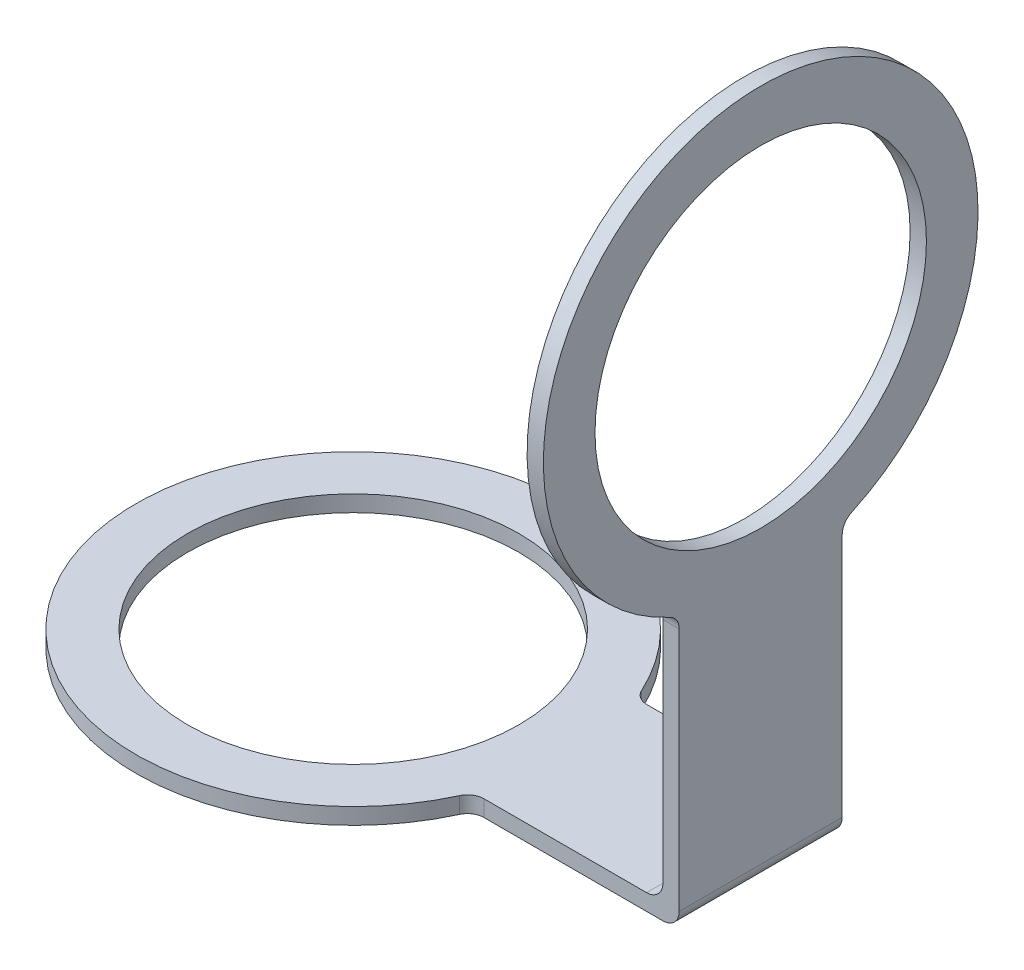
ISO-10303-21;
HEADER;
FILE_DESCRIPTION(('STEP AP214'),'2;1');
FILE_NAME('part.step','',(''),(''),'','','');
FILE_SCHEMA(('AUTOMOTIVE_DESIGN { 1 0 10303 214 1 1 1 1 }'));
ENDSEC;
DATA;
#1=APPLICATION_CONTEXT('core data for automotive mechanical design processes');
#2=APPLICATION_PROTOCOL_DEFINITION('international standard','automotive_design',2000,#1);
#3=PRODUCT_CONTEXT('',#1,'mechanical');
#4=PRODUCT('Part','Part','',(#3));
#5=PRODUCT_RELATED_PRODUCT_CATEGORY('part','',(#4));
#6=PRODUCT_DEFINITION_FORMATION('','',#4);
#7=PRODUCT_DEFINITION_CONTEXT('part definition',#1,'design');
#8=PRODUCT_DEFINITION('design','',#6,#7);
#9=PRODUCT_DEFINITION_SHAPE('','',#8);
#10=(LENGTH_UNIT() NAMED_UNIT(*) SI_UNIT(.MILLI.,.METRE.));
#11=(NAMED_UNIT(*) PLANE_ANGLE_UNIT() SI_UNIT($,.RADIAN.));
#12=(NAMED_UNIT(*) SI_UNIT($,.STERADIAN.) SOLID_ANGLE_UNIT());
#13=UNCERTAINTY_MEASURE_WITH_UNIT(LENGTH_MEASURE(1.E-05),#10,'distance_accuracy_value','');
#14=(GEOMETRIC_REPRESENTATION_CONTEXT(3) GLOBAL_UNCERTAINTY_ASSIGNED_CONTEXT((#13)) GLOBAL_UNIT_ASSIGNED_CONTEXT((#10,
#11,#12)) REPRESENTATION_CONTEXT('',''));
#15=CARTESIAN_POINT('',(0.,0.,0.));
#16=DIRECTION('',(0.,0.,1.));
#17=DIRECTION('',(1.,0.,0.));
#18=AXIS2_PLACEMENT_3D('',#15,#16,#17);
#19=CARTESIAN_POINT('',(0.,3.,0.));
#20=DIRECTION('',(0.,1.,0.));
#21=DIRECTION('',(0.,0.,1.));
#22=AXIS2_PLACEMENT_3D('',#19,#20,#21);
#23=PLANE('',#22);
#24=CARTESIAN_POINT('',(0.,3.,0.));
#25=DIRECTION('',(0.,1.,0.));
#26=DIRECTION('',(0.,0.,1.));
#27=AXIS2_PLACEMENT_3D('',#24,#25,#26);
#28=CIRCLE('',#27,30.5);
#29=CARTESIAN_POINT('',(0.,3.,30.5));
#30=VERTEX_POINT('',#29);
#31=EDGE_CURVE('E230',#30,#30,#28,.T.);
#32=ORIENTED_EDGE('',*,*,#31,.F.);
#33=EDGE_LOOP('',(#32));
#34=FACE_BOUND('',#33,.T.);
#35=DIRECTION('',(1.,0.,0.));
#36=VECTOR('',#35,1.);
#37=CARTESIAN_POINT('',(35.,3.,15.));
#38=LINE('',#37,#36);
#39=CARTESIAN_POINT('',(39.0512483795333,3.,15.));
#40=VERTEX_POINT('',#39);
#41=CARTESIAN_POINT('',(69.,3.,15.));
#42=VERTEX_POINT('',#41);
#43=EDGE_CURVE('E215',#40,#42,#38,.T.);
#44=ORIENTED_EDGE('',*,*,#43,.T.);
#45=DIRECTION('',(0.,0.,-1.));
#46=VECTOR('',#45,1.);
#47=CARTESIAN_POINT('',(69.,3.,0.));
#48=LINE('',#47,#46);
#49=CARTESIAN_POINT('',(69.,3.,-15.));
#50=VERTEX_POINT('',#49);
#51=EDGE_CURVE('E183',#42,#50,#48,.T.);
#52=ORIENTED_EDGE('',*,*,#51,.T.);
#53=DIRECTION('',(-1.,0.,0.));
#54=VECTOR('',#53,1.);
#55=CARTESIAN_POINT('',(35.,3.,-15.));
#56=LINE('',#55,#54);
#57=CARTESIAN_POINT('',(39.0512483795333,3.,-15.));
#58=VERTEX_POINT('',#57);
#59=EDGE_CURVE('E199',#50,#58,#56,.T.);
#60=ORIENTED_EDGE('',*,*,#59,.T.);
#61=CARTESIAN_POINT('',(39.0512483795333,3.,-18.));
#62=DIRECTION('',(0.,1.,0.));
#63=DIRECTION('',(0.,0.,1.));
#64=AXIS2_PLACEMENT_3D('',#61,#62,#63);
#65=CIRCLE('',#64,3.);
#66=CARTESIAN_POINT('',(36.3267426786356,3.,-16.7441860465116));
#67=VERTEX_POINT('',#66);
#68=EDGE_CURVE('E181',#58,#67,#65,.F.);
#69=ORIENTED_EDGE('',*,*,#68,.T.);
#70=CARTESIAN_POINT('',(0.,3.,0.));
#71=DIRECTION('',(0.,1.,0.));
#72=DIRECTION('',(0.,0.,1.));
#73=AXIS2_PLACEMENT_3D('',#70,#71,#72);
#74=CIRCLE('',#73,40.);
#75=CARTESIAN_POINT('',(36.3267426786356,3.,16.7441860465116));
#76=VERTEX_POINT('',#75);
#77=EDGE_CURVE('E147',#67,#76,#74,.T.);
#78=ORIENTED_EDGE('',*,*,#77,.T.);
#79=CARTESIAN_POINT('',(39.0512483795333,3.,18.));
#80=DIRECTION('',(0.,1.,0.));
#81=DIRECTION('',(0.,0.,1.));
#82=AXIS2_PLACEMENT_3D('',#79,#80,#81);
#83=CIRCLE('',#82,3.);
#84=EDGE_CURVE('E175',#76,#40,#83,.F.);
#85=ORIENTED_EDGE('',*,*,#84,.T.);
#86=EDGE_LOOP('',(#44,#52,#60,#69,#78,#85));
#87=FACE_BOUND('',#86,.T.);
#88=ADVANCED_FACE('F32',(#34,#87),#23,.T.);
#89=CARTESIAN_POINT('',(0.,0.,0.));
#90=DIRECTION('',(0.,1.,0.));
#91=DIRECTION('',(0.,0.,1.));
#92=AXIS2_PLACEMENT_3D('',#89,#90,#91);
#93=PLANE('',#92);
#94=DIRECTION('',(1.,0.,0.));
#95=VECTOR('',#94,1.);
#96=CARTESIAN_POINT('',(35.,0.,-15.));
#97=LINE('',#96,#95);
#98=CARTESIAN_POINT('',(39.0512483795333,0.,-15.));
#99=VERTEX_POINT('',#98);
#100=CARTESIAN_POINT('',(72.,0.,-15.));
#101=VERTEX_POINT('',#100);
#102=EDGE_CURVE('E223',#99,#101,#97,.T.);
#103=ORIENTED_EDGE('',*,*,#102,.T.);
#104=DIRECTION('',(0.,0.,1.));
#105=VECTOR('',#104,1.);
#106=CARTESIAN_POINT('',(72.,0.,15.));
#107=LINE('',#106,#105);
#108=CARTESIAN_POINT('',(72.,0.,15.));
#109=VERTEX_POINT('',#108);
#110=EDGE_CURVE('E188',#101,#109,#107,.T.);
#111=ORIENTED_EDGE('',*,*,#110,.T.);
#112=DIRECTION('',(-1.,0.,0.));
#113=VECTOR('',#112,1.);
#114=CARTESIAN_POINT('',(35.,0.,15.));
#115=LINE('',#114,#113);
#116=CARTESIAN_POINT('',(39.0512483795333,0.,15.));
#117=VERTEX_POINT('',#116);
#118=EDGE_CURVE('E227',#109,#117,#115,.T.);
#119=ORIENTED_EDGE('',*,*,#118,.T.);
#120=CARTESIAN_POINT('',(39.0512483795333,0.,18.));
#121=DIRECTION('',(0.,1.,0.));
#122=DIRECTION('',(0.,0.,1.));
#123=AXIS2_PLACEMENT_3D('',#120,#121,#122);
#124=CIRCLE('',#123,3.);
#125=CARTESIAN_POINT('',(36.3267426786356,0.,16.7441860465116));
#126=VERTEX_POINT('',#125);
#127=EDGE_CURVE('E177',#117,#126,#124,.T.);
#128=ORIENTED_EDGE('',*,*,#127,.T.);
#129=CARTESIAN_POINT('',(0.,0.,0.));
#130=DIRECTION('',(0.,1.,0.));
#131=DIRECTION('',(0.,0.,1.));
#132=AXIS2_PLACEMENT_3D('',#129,#130,#131);
#133=CIRCLE('',#132,40.);
#134=CARTESIAN_POINT('',(36.3267426786356,0.,-16.7441860465116));
#135=VERTEX_POINT('',#134);
#136=EDGE_CURVE('E152',#135,#126,#133,.T.);
#137=ORIENTED_EDGE('',*,*,#136,.F.);
#138=CARTESIAN_POINT('',(39.0512483795333,0.,-18.));
#139=DIRECTION('',(0.,1.,0.));
#140=DIRECTION('',(0.,0.,1.));
#141=AXIS2_PLACEMENT_3D('',#138,#139,#140);
#142=CIRCLE('',#141,3.);
#143=EDGE_CURVE('E179',#135,#99,#142,.T.);
#144=ORIENTED_EDGE('',*,*,#143,.T.);
#145=EDGE_LOOP('',(#103,#111,#119,#128,#137,#144));
#146=FACE_BOUND('',#145,.T.);
#147=CARTESIAN_POINT('',(0.,0.,0.));
#148=DIRECTION('',(0.,1.,0.));
#149=DIRECTION('',(0.,0.,1.));
#150=AXIS2_PLACEMENT_3D('',#147,#148,#149);
#151=CIRCLE('',#150,30.5);
#152=CARTESIAN_POINT('',(0.,0.,30.5));
#153=VERTEX_POINT('',#152);
#154=EDGE_CURVE('E229',#153,#153,#151,.T.);
#155=ORIENTED_EDGE('',*,*,#154,.T.);
#156=EDGE_LOOP('',(#155));
#157=FACE_BOUND('',#156,.T.);
#158=ADVANCED_FACE('F236',(#146,#157),#93,.F.);
#159=CARTESIAN_POINT('',(0.,3.,0.));
#160=DIRECTION('',(0.,-1.,0.));
#161=DIRECTION('',(0.,0.,-1.));
#162=AXIS2_PLACEMENT_3D('',#159,#160,#161);
#163=CYLINDRICAL_SURFACE('',#162,40.);
#164=ORIENTED_EDGE('',*,*,#136,.T.);
#165=DIRECTION('',(0.,-1.,0.));
#166=VECTOR('',#165,1.);
#167=CARTESIAN_POINT('',(36.3267426786356,3.,16.7441860465116));
#168=LINE('',#167,#166);
#169=EDGE_CURVE('E168',#126,#76,#168,.F.);
#170=ORIENTED_EDGE('',*,*,#169,.T.);
#171=ORIENTED_EDGE('',*,*,#77,.F.);
#172=DIRECTION('',(0.,-1.,0.));
#173=VECTOR('',#172,1.);
#174=CARTESIAN_POINT('',(36.3267426786356,3.,-16.7441860465116));
#175=LINE('',#174,#173);
#176=EDGE_CURVE('E165',#67,#135,#175,.T.);
#177=ORIENTED_EDGE('',*,*,#176,.T.);
#178=EDGE_LOOP('',(#164,#170,#171,#177));
#179=FACE_BOUND('',#178,.T.);
#180=ADVANCED_FACE('F240',(#179),#163,.T.);
#181=CARTESIAN_POINT('',(0.,3.,0.));
#182=DIRECTION('',(0.,-1.,0.));
#183=DIRECTION('',(0.,0.,-1.));
#184=AXIS2_PLACEMENT_3D('',#181,#182,#183);
#185=CYLINDRICAL_SURFACE('',#184,30.5);
#186=ORIENTED_EDGE('',*,*,#31,.T.);
#187=EDGE_LOOP('',(#186));
#188=FACE_BOUND('',#187,.T.);
#189=ORIENTED_EDGE('',*,*,#154,.F.);
#190=EDGE_LOOP('',(#189));
#191=FACE_BOUND('',#190,.T.);
#192=ADVANCED_FACE('F238',(#188,#191),#185,.F.);
#193=CARTESIAN_POINT('',(35.,-50.,-15.));
#194=DIRECTION('',(0.,0.,-1.));
#195=DIRECTION('',(-1.,0.,0.));
#196=AXIS2_PLACEMENT_3D('',#193,#194,#195);
#197=PLANE('',#196);
#198=DIRECTION('',(0.,1.,0.));
#199=VECTOR('',#198,1.);
#200=CARTESIAN_POINT('',(75.,-50.,-15.));
#201=LINE('',#200,#199);
#202=CARTESIAN_POINT('',(75.,3.,-15.));
#203=VERTEX_POINT('',#202);
#204=CARTESIAN_POINT('',(75.,48.029744055945,-15.));
#205=VERTEX_POINT('',#204);
#206=EDGE_CURVE('E125',#203,#205,#201,.T.);
#207=ORIENTED_EDGE('',*,*,#206,.F.);
#208=CARTESIAN_POINT('',(72.,3.,-15.));
#209=DIRECTION('',(0.,0.,-1.));
#210=DIRECTION('',(-1.,0.,0.));
#211=AXIS2_PLACEMENT_3D('',#208,#209,#210);
#212=CIRCLE('',#211,3.);
#213=EDGE_CURVE('E193',#203,#101,#212,.T.);
#214=ORIENTED_EDGE('',*,*,#213,.T.);
#215=ORIENTED_EDGE('',*,*,#102,.F.);
#216=DIRECTION('',(0.,-1.,0.));
#217=VECTOR('',#216,1.);
#218=CARTESIAN_POINT('',(39.0512483795333,-50.,-15.));
#219=LINE('',#218,#217);
#220=EDGE_CURVE('E160',#99,#58,#219,.F.);
#221=ORIENTED_EDGE('',*,*,#220,.T.);
#222=ORIENTED_EDGE('',*,*,#59,.F.);
#223=CARTESIAN_POINT('',(69.,6.,-15.));
#224=DIRECTION('',(0.,0.,-1.));
#225=DIRECTION('',(-1.,0.,0.));
#226=AXIS2_PLACEMENT_3D('',#223,#224,#225);
#227=CIRCLE('',#226,3.);
#228=CARTESIAN_POINT('',(72.,6.,-15.));
#229=VERTEX_POINT('',#228);
#230=EDGE_CURVE('E40',#50,#229,#227,.F.);
#231=ORIENTED_EDGE('',*,*,#230,.T.);
#232=DIRECTION('',(0.,1.,0.));
#233=VECTOR('',#232,1.);
#234=CARTESIAN_POINT('',(72.,0.,-15.));
#235=LINE('',#234,#233);
#236=CARTESIAN_POINT('',(72.,48.029744055945,-15.));
#237=VERTEX_POINT('',#236);
#238=EDGE_CURVE('E198',#229,#237,#235,.T.);
#239=ORIENTED_EDGE('',*,*,#238,.T.);
#240=DIRECTION('',(-1.,0.,0.));
#241=VECTOR('',#240,1.);
#242=CARTESIAN_POINT('',(75.,48.029744055945,-15.));
#243=LINE('',#242,#241);
#244=EDGE_CURVE('E163',#237,#205,#243,.F.);
#245=ORIENTED_EDGE('',*,*,#244,.T.);
#246=EDGE_LOOP('',(#207,#214,#215,#221,#222,#231,#239,#245));
#247=FACE_BOUND('',#246,.T.);
#248=ADVANCED_FACE('F197',(#247),#197,.T.);
#249=CARTESIAN_POINT('',(35.,-50.,15.));
#250=DIRECTION('',(0.,0.,1.));
#251=DIRECTION('',(1.,0.,0.));
#252=AXIS2_PLACEMENT_3D('',#249,#250,#251);
#253=PLANE('',#252);
#254=ORIENTED_EDGE('',*,*,#118,.F.);
#255=CARTESIAN_POINT('',(72.,3.,15.));
#256=DIRECTION('',(0.,0.,1.));
#257=DIRECTION('',(1.,0.,0.));
#258=AXIS2_PLACEMENT_3D('',#255,#256,#257);
#259=CIRCLE('',#258,3.);
#260=CARTESIAN_POINT('',(75.,3.,15.));
#261=VERTEX_POINT('',#260);
#262=EDGE_CURVE('E55',#109,#261,#259,.T.);
#263=ORIENTED_EDGE('',*,*,#262,.T.);
#264=DIRECTION('',(0.,1.,0.));
#265=VECTOR('',#264,1.);
#266=CARTESIAN_POINT('',(75.,-50.,15.));
#267=LINE('',#266,#265);
#268=CARTESIAN_POINT('',(75.,48.029744055945,15.));
#269=VERTEX_POINT('',#268);
#270=EDGE_CURVE('E219',#261,#269,#267,.T.);
#271=ORIENTED_EDGE('',*,*,#270,.T.);
#272=DIRECTION('',(-1.,0.,0.));
#273=VECTOR('',#272,1.);
#274=CARTESIAN_POINT('',(72.,48.029744055945,15.));
#275=LINE('',#274,#273);
#276=CARTESIAN_POINT('',(72.,48.029744055945,15.));
#277=VERTEX_POINT('',#276);
#278=EDGE_CURVE('E158',#269,#277,#275,.T.);
#279=ORIENTED_EDGE('',*,*,#278,.T.);
#280=DIRECTION('',(0.,-1.,0.));
#281=VECTOR('',#280,1.);
#282=CARTESIAN_POINT('',(72.,0.,15.));
#283=LINE('',#282,#281);
#284=CARTESIAN_POINT('',(72.,6.,15.));
#285=VERTEX_POINT('',#284);
#286=EDGE_CURVE('E141',#277,#285,#283,.T.);
#287=ORIENTED_EDGE('',*,*,#286,.T.);
#288=CARTESIAN_POINT('',(69.,6.,15.));
#289=DIRECTION('',(0.,0.,1.));
#290=DIRECTION('',(1.,0.,0.));
#291=AXIS2_PLACEMENT_3D('',#288,#289,#290);
#292=CIRCLE('',#291,3.);
#293=EDGE_CURVE('E11',#285,#42,#292,.F.);
#294=ORIENTED_EDGE('',*,*,#293,.T.);
#295=ORIENTED_EDGE('',*,*,#43,.F.);
#296=DIRECTION('',(0.,-1.,0.));
#297=VECTOR('',#296,1.);
#298=CARTESIAN_POINT('',(39.0512483795333,-50.,15.));
#299=LINE('',#298,#297);
#300=EDGE_CURVE('E149',#40,#117,#299,.T.);
#301=ORIENTED_EDGE('',*,*,#300,.T.);
#302=EDGE_LOOP('',(#254,#263,#271,#279,#287,#294,#295,#301));
#303=FACE_BOUND('',#302,.T.);
#304=ADVANCED_FACE('F214',(#303),#253,.T.);
#305=CARTESIAN_POINT('',(75.,-50.,-15.));
#306=DIRECTION('',(1.,0.,0.));
#307=DIRECTION('',(0.,0.,-1.));
#308=AXIS2_PLACEMENT_3D('',#305,#306,#307);
#309=PLANE('',#308);
#310=ORIENTED_EDGE('',*,*,#270,.F.);
#311=DIRECTION('',(0.,0.,1.));
#312=VECTOR('',#311,1.);
#313=CARTESIAN_POINT('',(75.,3.,-15.));
#314=LINE('',#313,#312);
#315=EDGE_CURVE('E47',#261,#203,#314,.F.);
#316=ORIENTED_EDGE('',*,*,#315,.T.);
#317=ORIENTED_EDGE('',*,*,#206,.T.);
#318=CARTESIAN_POINT('',(75.,48.029744055945,-18.));
#319=DIRECTION('',(1.,0.,0.));
#320=DIRECTION('',(0.,0.,-1.));
#321=AXIS2_PLACEMENT_3D('',#318,#319,#320);
#322=CIRCLE('',#321,3.);
#323=CARTESIAN_POINT('',(75.,50.7542497568427,-16.7441860465116));
#324=VERTEX_POINT('',#323);
#325=EDGE_CURVE('E119',#205,#324,#322,.F.);
#326=ORIENTED_EDGE('',*,*,#325,.T.);
#327=CARTESIAN_POINT('',(75.,87.0809924354783,0.));
#328=DIRECTION('',(1.,0.,0.));
#329=DIRECTION('',(0.,0.,-1.));
#330=AXIS2_PLACEMENT_3D('',#327,#328,#329);
#331=CIRCLE('',#330,40.);
#332=CARTESIAN_POINT('',(75.,50.7542497568427,16.7441860465116));
#333=VERTEX_POINT('',#332);
#334=EDGE_CURVE('E124',#324,#333,#331,.T.);
#335=ORIENTED_EDGE('',*,*,#334,.T.);
#336=CARTESIAN_POINT('',(75.,48.029744055945,18.));
#337=DIRECTION('',(1.,0.,0.));
#338=DIRECTION('',(0.,0.,-1.));
#339=AXIS2_PLACEMENT_3D('',#336,#337,#338);
#340=CIRCLE('',#339,3.);
#341=EDGE_CURVE('E171',#333,#269,#340,.F.);
#342=ORIENTED_EDGE('',*,*,#341,.T.);
#343=EDGE_LOOP('',(#310,#316,#317,#326,#335,#342));
#344=FACE_BOUND('',#343,.T.);
#345=CARTESIAN_POINT('',(75.,87.0809924354783,0.));
#346=DIRECTION('',(1.,0.,0.));
#347=DIRECTION('',(0.,0.,-1.));
#348=AXIS2_PLACEMENT_3D('',#345,#346,#347);
#349=CIRCLE('',#348,30.5);
#350=CARTESIAN_POINT('',(75.,87.0809924354783,-30.5));
#351=VERTEX_POINT('',#350);
#352=EDGE_CURVE('E402',#351,#351,#349,.T.);
#353=ORIENTED_EDGE('',*,*,#352,.F.);
#354=EDGE_LOOP('',(#353));
#355=FACE_BOUND('',#354,.T.);
#356=ADVANCED_FACE('F121',(#344,#355),#309,.T.);
#357=CARTESIAN_POINT('',(72.,87.0809924354783,0.));
#358=DIRECTION('',(1.,0.,0.));
#359=DIRECTION('',(0.,0.,-1.));
#360=AXIS2_PLACEMENT_3D('',#357,#358,#359);
#361=CYLINDRICAL_SURFACE('',#360,40.);
#362=CARTESIAN_POINT('',(72.,87.0809924354783,0.));
#363=DIRECTION('',(1.,0.,0.));
#364=DIRECTION('',(0.,0.,-1.));
#365=AXIS2_PLACEMENT_3D('',#362,#363,#364);
#366=CIRCLE('',#365,40.);
#367=CARTESIAN_POINT('',(72.,50.7542497568427,-16.7441860465116));
#368=VERTEX_POINT('',#367);
#369=CARTESIAN_POINT('',(72.,50.7542497568427,16.7441860465116));
#370=VERTEX_POINT('',#369);
#371=EDGE_CURVE('E208',#368,#370,#366,.T.);
#372=ORIENTED_EDGE('',*,*,#371,.T.);
#373=DIRECTION('',(1.,0.,0.));
#374=VECTOR('',#373,1.);
#375=CARTESIAN_POINT('',(72.,50.7542497568427,16.7441860465116));
#376=LINE('',#375,#374);
#377=EDGE_CURVE('E140',#370,#333,#376,.T.);
#378=ORIENTED_EDGE('',*,*,#377,.T.);
#379=ORIENTED_EDGE('',*,*,#334,.F.);
#380=DIRECTION('',(1.,0.,0.));
#381=VECTOR('',#380,1.);
#382=CARTESIAN_POINT('',(72.,50.7542497568427,-16.7441860465116));
#383=LINE('',#382,#381);
#384=EDGE_CURVE('E137',#324,#368,#383,.F.);
#385=ORIENTED_EDGE('',*,*,#384,.T.);
#386=EDGE_LOOP('',(#372,#378,#379,#385));
#387=FACE_BOUND('',#386,.T.);
#388=ADVANCED_FACE('F136',(#387),#361,.T.);
#389=CARTESIAN_POINT('',(72.,87.0809924354783,0.));
#390=DIRECTION('',(1.,0.,0.));
#391=DIRECTION('',(0.,0.,-1.));
#392=AXIS2_PLACEMENT_3D('',#389,#390,#391);
#393=PLANE('',#392);
#394=ORIENTED_EDGE('',*,*,#238,.F.);
#395=DIRECTION('',(0.,0.,-1.));
#396=VECTOR('',#395,1.);
#397=CARTESIAN_POINT('',(72.,6.00000000000001,0.));
#398=LINE('',#397,#396);
#399=EDGE_CURVE('E186',#229,#285,#398,.F.);
#400=ORIENTED_EDGE('',*,*,#399,.T.);
#401=ORIENTED_EDGE('',*,*,#286,.F.);
#402=CARTESIAN_POINT('',(72.,48.029744055945,18.));
#403=DIRECTION('',(1.,0.,0.));
#404=DIRECTION('',(0.,0.,-1.));
#405=AXIS2_PLACEMENT_3D('',#402,#403,#404);
#406=CIRCLE('',#405,3.);
#407=EDGE_CURVE('E131',#277,#370,#406,.T.);
#408=ORIENTED_EDGE('',*,*,#407,.T.);
#409=ORIENTED_EDGE('',*,*,#371,.F.);
#410=CARTESIAN_POINT('',(72.,48.029744055945,-18.));
#411=DIRECTION('',(1.,0.,0.));
#412=DIRECTION('',(0.,0.,-1.));
#413=AXIS2_PLACEMENT_3D('',#410,#411,#412);
#414=CIRCLE('',#413,3.);
#415=EDGE_CURVE('E130',#368,#237,#414,.T.);
#416=ORIENTED_EDGE('',*,*,#415,.T.);
#417=EDGE_LOOP('',(#394,#400,#401,#408,#409,#416));
#418=FACE_BOUND('',#417,.T.);
#419=CARTESIAN_POINT('',(72.,87.0809924354783,0.));
#420=DIRECTION('',(1.,0.,0.));
#421=DIRECTION('',(0.,0.,-1.));
#422=AXIS2_PLACEMENT_3D('',#419,#420,#421);
#423=CIRCLE('',#422,30.5);
#424=CARTESIAN_POINT('',(72.,87.0809924354783,-30.5));
#425=VERTEX_POINT('',#424);
#426=EDGE_CURVE('E142',#425,#425,#423,.T.);
#427=ORIENTED_EDGE('',*,*,#426,.T.);
#428=EDGE_LOOP('',(#427));
#429=FACE_BOUND('',#428,.T.);
#430=ADVANCED_FACE('F204',(#418,#429),#393,.F.);
#431=CARTESIAN_POINT('',(72.,87.0809924354783,0.));
#432=DIRECTION('',(1.,0.,0.));
#433=DIRECTION('',(0.,0.,-1.));
#434=AXIS2_PLACEMENT_3D('',#431,#432,#433);
#435=CYLINDRICAL_SURFACE('',#434,30.5);
#436=ORIENTED_EDGE('',*,*,#426,.F.);
#437=EDGE_LOOP('',(#436));
#438=FACE_BOUND('',#437,.T.);
#439=ORIENTED_EDGE('',*,*,#352,.T.);
#440=EDGE_LOOP('',(#439));
#441=FACE_BOUND('',#440,.T.);
#442=ADVANCED_FACE('F264',(#438,#441),#435,.F.);
#443=CARTESIAN_POINT('',(72.,48.029744055945,18.));
#444=DIRECTION('',(1.,0.,0.));
#445=DIRECTION('',(0.,0.,-1.));
#446=AXIS2_PLACEMENT_3D('',#443,#444,#445);
#447=CYLINDRICAL_SURFACE('',#446,3.);
#448=ORIENTED_EDGE('',*,*,#407,.F.);
#449=ORIENTED_EDGE('',*,*,#278,.F.);
#450=ORIENTED_EDGE('',*,*,#341,.F.);
#451=ORIENTED_EDGE('',*,*,#377,.F.);
#452=EDGE_LOOP('',(#448,#449,#450,#451));
#453=FACE_BOUND('',#452,.T.);
#454=ADVANCED_FACE('F261',(#453),#447,.F.);
#455=CARTESIAN_POINT('',(72.,48.029744055945,-18.));
#456=DIRECTION('',(1.,0.,0.));
#457=DIRECTION('',(0.,0.,-1.));
#458=AXIS2_PLACEMENT_3D('',#455,#456,#457);
#459=CYLINDRICAL_SURFACE('',#458,3.);
#460=ORIENTED_EDGE('',*,*,#415,.F.);
#461=ORIENTED_EDGE('',*,*,#384,.F.);
#462=ORIENTED_EDGE('',*,*,#325,.F.);
#463=ORIENTED_EDGE('',*,*,#244,.F.);
#464=EDGE_LOOP('',(#460,#461,#462,#463));
#465=FACE_BOUND('',#464,.T.);
#466=ADVANCED_FACE('F145',(#465),#459,.F.);
#467=CARTESIAN_POINT('',(39.0512483795333,3.,18.));
#468=DIRECTION('',(0.,-1.,0.));
#469=DIRECTION('',(0.,0.,-1.));
#470=AXIS2_PLACEMENT_3D('',#467,#468,#469);
#471=CYLINDRICAL_SURFACE('',#470,3.);
#472=ORIENTED_EDGE('',*,*,#127,.F.);
#473=ORIENTED_EDGE('',*,*,#300,.F.);
#474=ORIENTED_EDGE('',*,*,#84,.F.);
#475=ORIENTED_EDGE('',*,*,#169,.F.);
#476=EDGE_LOOP('',(#472,#473,#474,#475));
#477=FACE_BOUND('',#476,.T.);
#478=ADVANCED_FACE('F268',(#477),#471,.F.);
#479=CARTESIAN_POINT('',(39.0512483795333,3.,-18.));
#480=DIRECTION('',(0.,-1.,0.));
#481=DIRECTION('',(0.,0.,-1.));
#482=AXIS2_PLACEMENT_3D('',#479,#480,#481);
#483=CYLINDRICAL_SURFACE('',#482,3.);
#484=ORIENTED_EDGE('',*,*,#68,.F.);
#485=ORIENTED_EDGE('',*,*,#220,.F.);
#486=ORIENTED_EDGE('',*,*,#143,.F.);
#487=ORIENTED_EDGE('',*,*,#176,.F.);
#488=EDGE_LOOP('',(#484,#485,#486,#487));
#489=FACE_BOUND('',#488,.T.);
#490=ADVANCED_FACE('F271',(#489),#483,.F.);
#491=CARTESIAN_POINT('',(69.,6.,0.));
#492=DIRECTION('',(0.,0.,-1.));
#493=DIRECTION('',(-1.,0.,0.));
#494=AXIS2_PLACEMENT_3D('',#491,#492,#493);
#495=CYLINDRICAL_SURFACE('',#494,3.);
#496=ORIENTED_EDGE('',*,*,#293,.F.);
#497=ORIENTED_EDGE('',*,*,#399,.F.);
#498=ORIENTED_EDGE('',*,*,#230,.F.);
#499=ORIENTED_EDGE('',*,*,#51,.F.);
#500=EDGE_LOOP('',(#496,#497,#498,#499));
#501=FACE_BOUND('',#500,.T.);
#502=ADVANCED_FACE('F211',(#501),#495,.F.);
#503=CARTESIAN_POINT('',(72.,3.,0.));
#504=DIRECTION('',(0.,0.,-1.));
#505=DIRECTION('',(-1.,0.,0.));
#506=AXIS2_PLACEMENT_3D('',#503,#504,#505);
#507=CYLINDRICAL_SURFACE('',#506,3.);
#508=ORIENTED_EDGE('',*,*,#213,.F.);
#509=ORIENTED_EDGE('',*,*,#315,.F.);
#510=ORIENTED_EDGE('',*,*,#262,.F.);
#511=ORIENTED_EDGE('',*,*,#110,.F.);
#512=EDGE_LOOP('',(#508,#509,#510,#511));
#513=FACE_BOUND('',#512,.T.);
#514=ADVANCED_FACE('F34',(#513),#507,.T.);
#515=CLOSED_SHELL('',(#88,#158,#180,#192,#248,#304,#356,#388,#430,#442,#454,#466,#478,#490,#502,#514));
#516=MANIFOLD_SOLID_BREP('B2',#515);
#517=ADVANCED_BREP_SHAPE_REPRESENTATION('',(#18,#516),#14);
#518=SHAPE_DEFINITION_REPRESENTATION(#9,#517);
ENDSEC;
END-ISO-10303-21;
